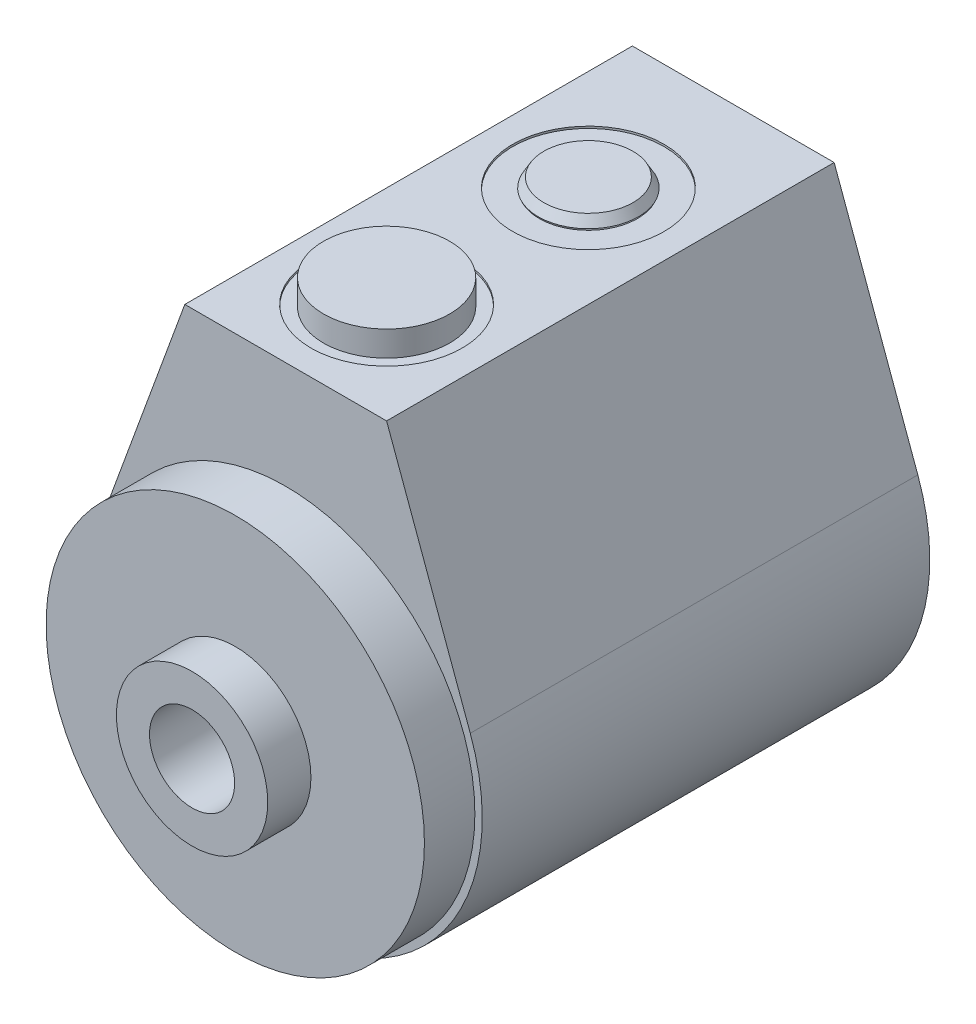
ISO-10303-21;
HEADER;
FILE_DESCRIPTION(('STEP AP214'),'2;1');
FILE_NAME('part.step','',(''),(''),'','','');
FILE_SCHEMA(('AUTOMOTIVE_DESIGN { 1 0 10303 214 1 1 1 1 }'));
ENDSEC;
DATA;
#1=APPLICATION_CONTEXT('core data for automotive mechanical design processes');
#2=APPLICATION_PROTOCOL_DEFINITION('international standard','automotive_design',2000,#1);
#3=PRODUCT_CONTEXT('',#1,'mechanical');
#4=PRODUCT('Part','Part','',(#3));
#5=PRODUCT_RELATED_PRODUCT_CATEGORY('part','',(#4));
#6=PRODUCT_DEFINITION_FORMATION('','',#4);
#7=PRODUCT_DEFINITION_CONTEXT('part definition',#1,'design');
#8=PRODUCT_DEFINITION('design','',#6,#7);
#9=PRODUCT_DEFINITION_SHAPE('','',#8);
#10=(LENGTH_UNIT() NAMED_UNIT(*) SI_UNIT(.MILLI.,.METRE.));
#11=(NAMED_UNIT(*) PLANE_ANGLE_UNIT() SI_UNIT($,.RADIAN.));
#12=(NAMED_UNIT(*) SI_UNIT($,.STERADIAN.) SOLID_ANGLE_UNIT());
#13=UNCERTAINTY_MEASURE_WITH_UNIT(LENGTH_MEASURE(1.E-05),#10,'distance_accuracy_value','');
#14=(GEOMETRIC_REPRESENTATION_CONTEXT(3) GLOBAL_UNCERTAINTY_ASSIGNED_CONTEXT((#13)) GLOBAL_UNIT_ASSIGNED_CONTEXT((#10,
#11,#12)) REPRESENTATION_CONTEXT('',''));
#15=CARTESIAN_POINT('',(0.,0.,0.));
#16=DIRECTION('',(0.,0.,1.));
#17=DIRECTION('',(1.,0.,0.));
#18=AXIS2_PLACEMENT_3D('',#15,#16,#17);
#19=CARTESIAN_POINT('',(0.,38.481,18.2372));
#20=DIRECTION('',(0.,-1.,0.));
#21=DIRECTION('',(0.,0.,-1.));
#22=AXIS2_PLACEMENT_3D('',#19,#20,#21);
#23=PLANE('',#22);
#24=CARTESIAN_POINT('',(0.,38.481,18.2372));
#25=DIRECTION('',(0.,1.,0.));
#26=DIRECTION('',(0.,0.,1.));
#27=AXIS2_PLACEMENT_3D('',#24,#25,#26);
#28=CIRCLE('',#27,5.60995924864142);
#29=CARTESIAN_POINT('',(0.,38.481,23.8471592486414));
#30=VERTEX_POINT('',#29);
#31=EDGE_CURVE('E11',#30,#30,#28,.T.);
#32=ORIENTED_EDGE('',*,*,#31,.T.);
#33=EDGE_LOOP('',(#32));
#34=FACE_BOUND('',#33,.T.);
#35=ADVANCED_FACE('F42',(#34),#23,.F.);
#36=CARTESIAN_POINT('',(0.,37.2872,18.2372));
#37=DIRECTION('',(0.,-1.,0.));
#38=DIRECTION('',(0.,0.,-1.));
#39=AXIS2_PLACEMENT_3D('',#36,#37,#38);
#40=CONICAL_SURFACE('',#39,6.2992,0.523598775598302);
#41=ORIENTED_EDGE('',*,*,#31,.F.);
#42=EDGE_LOOP('',(#41));
#43=FACE_BOUND('',#42,.T.);
#44=CARTESIAN_POINT('',(0.,37.2872,18.2372));
#45=DIRECTION('',(0.,1.,0.));
#46=DIRECTION('',(0.,0.,1.));
#47=AXIS2_PLACEMENT_3D('',#44,#45,#46);
#48=CIRCLE('',#47,6.2992);
#49=CARTESIAN_POINT('',(0.,37.2872,24.5364));
#50=VERTEX_POINT('',#49);
#51=EDGE_CURVE('E48',#50,#50,#48,.T.);
#52=ORIENTED_EDGE('',*,*,#51,.T.);
#53=EDGE_LOOP('',(#52));
#54=FACE_BOUND('',#53,.T.);
#55=ADVANCED_FACE('F54',(#43,#54),#40,.T.);
#56=CARTESIAN_POINT('',(0.,37.2872,11.938));
#57=DIRECTION('',(0.,1.,0.));
#58=DIRECTION('',(0.,0.,1.));
#59=AXIS2_PLACEMENT_3D('',#56,#57,#58);
#60=PLANE('',#59);
#61=ORIENTED_EDGE('',*,*,#51,.F.);
#62=EDGE_LOOP('',(#61));
#63=FACE_BOUND('',#62,.T.);
#64=ADVANCED_FACE('F56',(#63),#60,.F.);
#65=CLOSED_SHELL('',(#35,#55,#64));
#66=MANIFOLD_SOLID_BREP('B2',#65);
#67=CARTESIAN_POINT('',(0.,22.225,0.431799999999998));
#68=DIRECTION('',(0.,0.,1.));
#69=DIRECTION('',(1.,0.,0.));
#70=AXIS2_PLACEMENT_3D('',#67,#68,#69);
#71=TOROIDAL_SURFACE('',#70,4.7117,0.889000000000001);
#72=CARTESIAN_POINT('',(5.6007,22.225,0.431799999999998));
#73=VERTEX_POINT('',#72);
#74=VERTEX_LOOP('',#73);
#75=FACE_BOUND('',#74,.T.);
#76=ADVANCED_FACE('F92',(#75),#71,.T.);
#77=CLOSED_SHELL('',(#76));
#78=MANIFOLD_SOLID_BREP('B6',#77);
#79=CARTESIAN_POINT('',(12.7,37.2872,0.));
#80=DIRECTION('',(0.,1.,0.));
#81=DIRECTION('',(0.,0.,1.));
#82=AXIS2_PLACEMENT_3D('',#79,#80,#81);
#83=PLANE('',#82);
#84=DIRECTION('',(-1.,0.,0.));
#85=VECTOR('',#84,1.);
#86=CARTESIAN_POINT('',(12.7,37.2872,56.3372));
#87=LINE('',#86,#85);
#88=CARTESIAN_POINT('',(12.7,37.2872,56.3372));
#89=VERTEX_POINT('',#88);
#90=CARTESIAN_POINT('',(-12.7,37.2872,56.3372));
#91=VERTEX_POINT('',#90);
#92=EDGE_CURVE('E158',#89,#91,#87,.T.);
#93=ORIENTED_EDGE('',*,*,#92,.F.);
#94=DIRECTION('',(0.,0.,1.));
#95=VECTOR('',#94,1.);
#96=CARTESIAN_POINT('',(12.7,37.2872,0.));
#97=LINE('',#96,#95);
#98=CARTESIAN_POINT('',(12.7,37.2872,0.));
#99=VERTEX_POINT('',#98);
#100=EDGE_CURVE('E153',#99,#89,#97,.T.);
#101=ORIENTED_EDGE('',*,*,#100,.F.);
#102=DIRECTION('',(-1.,0.,0.));
#103=VECTOR('',#102,1.);
#104=CARTESIAN_POINT('',(12.7,37.2872,0.));
#105=LINE('',#104,#103);
#106=CARTESIAN_POINT('',(-12.7,37.2872,0.));
#107=VERTEX_POINT('',#106);
#108=EDGE_CURVE('E156',#99,#107,#105,.T.);
#109=ORIENTED_EDGE('',*,*,#108,.T.);
#110=DIRECTION('',(0.,0.,1.));
#111=VECTOR('',#110,1.);
#112=CARTESIAN_POINT('',(-12.7,37.2872,0.));
#113=LINE('',#112,#111);
#114=EDGE_CURVE('E139',#107,#91,#113,.T.);
#115=ORIENTED_EDGE('',*,*,#114,.T.);
#116=EDGE_LOOP('',(#93,#101,#109,#115));
#117=FACE_BOUND('',#116,.T.);
#118=CARTESIAN_POINT('',(0.,37.2872,43.6372));
#119=DIRECTION('',(0.,1.,0.));
#120=DIRECTION('',(0.,0.,1.));
#121=AXIS2_PLACEMENT_3D('',#118,#119,#120);
#122=CIRCLE('',#121,9.52500000000001);
#123=CARTESIAN_POINT('',(0.,37.2872,53.1622));
#124=VERTEX_POINT('',#123);
#125=EDGE_CURVE('E243',#124,#124,#122,.T.);
#126=ORIENTED_EDGE('',*,*,#125,.F.);
#127=EDGE_LOOP('',(#126));
#128=FACE_BOUND('',#127,.T.);
#129=CARTESIAN_POINT('',(0.,37.2872,18.2372));
#130=DIRECTION('',(0.,-1.,0.));
#131=DIRECTION('',(0.,0.,-1.));
#132=AXIS2_PLACEMENT_3D('',#129,#130,#131);
#133=CIRCLE('',#132,9.52499999998571);
#134=CARTESIAN_POINT('',(0.,37.2872,8.71220000001428));
#135=VERTEX_POINT('',#134);
#136=EDGE_CURVE('E259',#135,#135,#133,.T.);
#137=ORIENTED_EDGE('',*,*,#136,.T.);
#138=EDGE_LOOP('',(#137));
#139=FACE_BOUND('',#138,.T.);
#140=ADVANCED_FACE('F106',(#117,#128,#139),#83,.T.);
#141=CARTESIAN_POINT('',(0.,0.,6.35));
#142=DIRECTION('',(0.,0.,1.));
#143=DIRECTION('',(1.,0.,0.));
#144=AXIS2_PLACEMENT_3D('',#141,#142,#143);
#145=PLANE('',#144);
#146=CARTESIAN_POINT('',(0.,0.,6.35));
#147=DIRECTION('',(0.,0.,-1.));
#148=DIRECTION('',(-1.,0.,0.));
#149=AXIS2_PLACEMENT_3D('',#146,#147,#148);
#150=CIRCLE('',#149,11.938);
#151=CARTESIAN_POINT('',(-11.938,0.,6.35));
#152=VERTEX_POINT('',#151);
#153=EDGE_CURVE('E240',#152,#152,#150,.T.);
#154=ORIENTED_EDGE('',*,*,#153,.T.);
#155=EDGE_LOOP('',(#154));
#156=FACE_BOUND('',#155,.T.);
#157=CARTESIAN_POINT('',(0.,0.,6.35));
#158=DIRECTION('',(0.,0.,1.));
#159=DIRECTION('',(1.,0.,0.));
#160=AXIS2_PLACEMENT_3D('',#157,#158,#159);
#161=CIRCLE('',#160,9.525);
#162=CARTESIAN_POINT('',(9.525,0.,6.35));
#163=VERTEX_POINT('',#162);
#164=EDGE_CURVE('E90',#163,#163,#161,.F.);
#165=ORIENTED_EDGE('',*,*,#164,.F.);
#166=EDGE_LOOP('',(#165));
#167=FACE_BOUND('',#166,.T.);
#168=ADVANCED_FACE('F197',(#156,#167),#145,.F.);
#169=CARTESIAN_POINT('',(0.,0.,56.3372));
#170=DIRECTION('',(0.,0.,1.));
#171=DIRECTION('',(1.,0.,0.));
#172=AXIS2_PLACEMENT_3D('',#169,#170,#171);
#173=PLANE('',#172);
#174=CARTESIAN_POINT('',(0.,0.,56.3372));
#175=DIRECTION('',(0.,0.,1.));
#176=DIRECTION('',(1.,0.,0.));
#177=AXIS2_PLACEMENT_3D('',#174,#175,#176);
#178=CIRCLE('',#177,24.7396);
#179=CARTESIAN_POINT('',(-23.2330948392539,8.5012418122432,56.3372));
#180=VERTEX_POINT('',#179);
#181=CARTESIAN_POINT('',(23.2330948392539,8.5012418122432,56.3372));
#182=VERTEX_POINT('',#181);
#183=EDGE_CURVE('E174',#180,#182,#178,.T.);
#184=ORIENTED_EDGE('',*,*,#183,.T.);
#185=DIRECTION('',(-0.34362891122909,0.93910551663139,0.));
#186=VECTOR('',#185,1.);
#187=CARTESIAN_POINT('',(23.2330948392539,8.5012418122432,56.3372));
#188=LINE('',#187,#186);
#189=EDGE_CURVE('E177',#182,#89,#188,.T.);
#190=ORIENTED_EDGE('',*,*,#189,.T.);
#191=ORIENTED_EDGE('',*,*,#92,.T.);
#192=DIRECTION('',(-0.34362891122909,-0.93910551663139,0.));
#193=VECTOR('',#192,1.);
#194=CARTESIAN_POINT('',(-12.7,37.2872,56.3372));
#195=LINE('',#194,#193);
#196=EDGE_CURVE('E169',#91,#180,#195,.T.);
#197=ORIENTED_EDGE('',*,*,#196,.T.);
#198=EDGE_LOOP('',(#184,#190,#191,#197));
#199=FACE_BOUND('',#198,.T.);
#200=CARTESIAN_POINT('',(0.,0.,56.3372));
#201=DIRECTION('',(0.,0.,1.));
#202=DIRECTION('',(1.,0.,0.));
#203=AXIS2_PLACEMENT_3D('',#200,#201,#202);
#204=CIRCLE('',#203,23.8125);
#205=CARTESIAN_POINT('',(23.8125,0.,56.3372));
#206=VERTEX_POINT('',#205);
#207=EDGE_CURVE('E246',#206,#206,#204,.T.);
#208=ORIENTED_EDGE('',*,*,#207,.F.);
#209=EDGE_LOOP('',(#208));
#210=FACE_BOUND('',#209,.T.);
#211=ADVANCED_FACE('F185',(#199,#210),#173,.T.);
#212=CARTESIAN_POINT('',(0.,0.,0.));
#213=DIRECTION('',(0.,0.,1.));
#214=DIRECTION('',(1.,0.,0.));
#215=AXIS2_PLACEMENT_3D('',#212,#213,#214);
#216=CYLINDRICAL_SURFACE('',#215,24.7396);
#217=ORIENTED_EDGE('',*,*,#183,.F.);
#218=DIRECTION('',(0.,0.,1.));
#219=VECTOR('',#218,1.);
#220=CARTESIAN_POINT('',(-23.2330948392539,8.5012418122432,0.));
#221=LINE('',#220,#219);
#222=CARTESIAN_POINT('',(-23.2330948392539,8.5012418122432,0.));
#223=VERTEX_POINT('',#222);
#224=EDGE_CURVE('E115',#223,#180,#221,.T.);
#225=ORIENTED_EDGE('',*,*,#224,.F.);
#226=CARTESIAN_POINT('',(0.,0.,0.));
#227=DIRECTION('',(0.,0.,1.));
#228=DIRECTION('',(1.,0.,0.));
#229=AXIS2_PLACEMENT_3D('',#226,#227,#228);
#230=CIRCLE('',#229,24.7396);
#231=CARTESIAN_POINT('',(23.2330948392539,8.5012418122432,0.));
#232=VERTEX_POINT('',#231);
#233=EDGE_CURVE('E167',#223,#232,#230,.T.);
#234=ORIENTED_EDGE('',*,*,#233,.T.);
#235=DIRECTION('',(0.,0.,1.));
#236=VECTOR('',#235,1.);
#237=CARTESIAN_POINT('',(23.2330948392539,8.5012418122432,0.));
#238=LINE('',#237,#236);
#239=EDGE_CURVE('E150',#232,#182,#238,.T.);
#240=ORIENTED_EDGE('',*,*,#239,.T.);
#241=EDGE_LOOP('',(#217,#225,#234,#240));
#242=FACE_BOUND('',#241,.T.);
#243=ADVANCED_FACE('F108',(#242),#216,.T.);
#244=CARTESIAN_POINT('',(-12.7,37.2872,0.));
#245=DIRECTION('',(-0.93910551663139,0.34362891122909,0.));
#246=DIRECTION('',(-0.34362891122909,-0.93910551663139,0.));
#247=AXIS2_PLACEMENT_3D('',#244,#245,#246);
#248=PLANE('',#247);
#249=ORIENTED_EDGE('',*,*,#196,.F.);
#250=ORIENTED_EDGE('',*,*,#114,.F.);
#251=DIRECTION('',(-0.34362891122909,-0.93910551663139,0.));
#252=VECTOR('',#251,1.);
#253=CARTESIAN_POINT('',(-12.7,37.2872,0.));
#254=LINE('',#253,#252);
#255=EDGE_CURVE('E164',#107,#223,#254,.T.);
#256=ORIENTED_EDGE('',*,*,#255,.T.);
#257=ORIENTED_EDGE('',*,*,#224,.T.);
#258=EDGE_LOOP('',(#249,#250,#256,#257));
#259=FACE_BOUND('',#258,.T.);
#260=ADVANCED_FACE('F187',(#259),#248,.T.);
#261=CARTESIAN_POINT('',(23.2330948392539,8.5012418122432,0.));
#262=DIRECTION('',(0.93910551663139,0.34362891122909,0.));
#263=DIRECTION('',(-0.34362891122909,0.93910551663139,0.));
#264=AXIS2_PLACEMENT_3D('',#261,#262,#263);
#265=PLANE('',#264);
#266=ORIENTED_EDGE('',*,*,#189,.F.);
#267=ORIENTED_EDGE('',*,*,#239,.F.);
#268=DIRECTION('',(-0.34362891122909,0.93910551663139,0.));
#269=VECTOR('',#268,1.);
#270=CARTESIAN_POINT('',(23.2330948392539,8.5012418122432,0.));
#271=LINE('',#270,#269);
#272=EDGE_CURVE('E163',#232,#99,#271,.T.);
#273=ORIENTED_EDGE('',*,*,#272,.T.);
#274=ORIENTED_EDGE('',*,*,#100,.T.);
#275=EDGE_LOOP('',(#266,#267,#273,#274));
#276=FACE_BOUND('',#275,.T.);
#277=ADVANCED_FACE('F166',(#276),#265,.T.);
#278=CARTESIAN_POINT('',(0.,0.,0.));
#279=DIRECTION('',(0.,0.,1.));
#280=DIRECTION('',(1.,0.,0.));
#281=AXIS2_PLACEMENT_3D('',#278,#279,#280);
#282=PLANE('',#281);
#283=CARTESIAN_POINT('',(0.,22.225,0.));
#284=DIRECTION('',(0.,0.,-1.));
#285=DIRECTION('',(-1.,0.,0.));
#286=AXIS2_PLACEMENT_3D('',#283,#284,#285);
#287=CIRCLE('',#286,5.6007);
#288=CARTESIAN_POINT('',(-5.6007,22.225,0.));
#289=VERTEX_POINT('',#288);
#290=EDGE_CURVE('E227',#289,#289,#287,.T.);
#291=ORIENTED_EDGE('',*,*,#290,.F.);
#292=EDGE_LOOP('',(#291));
#293=FACE_BOUND('',#292,.T.);
#294=CARTESIAN_POINT('',(-18.2626,-1.27527128061192E-13,0.));
#295=DIRECTION('',(0.,0.,-1.));
#296=DIRECTION('',(-1.,0.,0.));
#297=AXIS2_PLACEMENT_3D('',#294,#295,#296);
#298=CIRCLE('',#297,3.31470000000001);
#299=CARTESIAN_POINT('',(-21.5773,-1.27527128061192E-13,0.));
#300=VERTEX_POINT('',#299);
#301=EDGE_CURVE('E231',#300,#300,#298,.T.);
#302=ORIENTED_EDGE('',*,*,#301,.F.);
#303=EDGE_LOOP('',(#302));
#304=FACE_BOUND('',#303,.T.);
#305=CARTESIAN_POINT('',(18.2626,0.,0.));
#306=DIRECTION('',(0.,0.,-1.));
#307=DIRECTION('',(-1.,0.,0.));
#308=AXIS2_PLACEMENT_3D('',#305,#306,#307);
#309=CIRCLE('',#308,3.31470000000001);
#310=CARTESIAN_POINT('',(14.9479,0.,0.));
#311=VERTEX_POINT('',#310);
#312=EDGE_CURVE('E235',#311,#311,#309,.T.);
#313=ORIENTED_EDGE('',*,*,#312,.F.);
#314=EDGE_LOOP('',(#313));
#315=FACE_BOUND('',#314,.T.);
#316=CARTESIAN_POINT('',(0.,0.,0.));
#317=DIRECTION('',(0.,0.,-1.));
#318=DIRECTION('',(-1.,0.,0.));
#319=AXIS2_PLACEMENT_3D('',#316,#317,#318);
#320=CIRCLE('',#319,11.938);
#321=CARTESIAN_POINT('',(-11.938,0.,0.));
#322=VERTEX_POINT('',#321);
#323=EDGE_CURVE('E238',#322,#322,#320,.T.);
#324=ORIENTED_EDGE('',*,*,#323,.F.);
#325=EDGE_LOOP('',(#324));
#326=FACE_BOUND('',#325,.T.);
#327=ORIENTED_EDGE('',*,*,#233,.F.);
#328=ORIENTED_EDGE('',*,*,#255,.F.);
#329=ORIENTED_EDGE('',*,*,#108,.F.);
#330=ORIENTED_EDGE('',*,*,#272,.F.);
#331=EDGE_LOOP('',(#327,#328,#329,#330));
#332=FACE_BOUND('',#331,.T.);
#333=ADVANCED_FACE('F162',(#293,#304,#315,#326,#332),#282,.F.);
#334=CARTESIAN_POINT('',(0.,37.0332,43.6372));
#335=DIRECTION('',(0.,-1.,0.));
#336=DIRECTION('',(0.,0.,-1.));
#337=AXIS2_PLACEMENT_3D('',#334,#335,#336);
#338=PLANE('',#337);
#339=CARTESIAN_POINT('',(0.,37.0332,43.6372));
#340=DIRECTION('',(0.,1.,0.));
#341=DIRECTION('',(0.,0.,1.));
#342=AXIS2_PLACEMENT_3D('',#339,#340,#341);
#343=CIRCLE('',#342,7.9375);
#344=CARTESIAN_POINT('',(0.,37.0332,51.5747));
#345=VERTEX_POINT('',#344);
#346=EDGE_CURVE('E283',#345,#345,#343,.T.);
#347=ORIENTED_EDGE('',*,*,#346,.F.);
#348=EDGE_LOOP('',(#347));
#349=FACE_BOUND('',#348,.T.);
#350=CARTESIAN_POINT('',(0.,37.0332,43.6372));
#351=DIRECTION('',(0.,1.,0.));
#352=DIRECTION('',(0.,0.,1.));
#353=AXIS2_PLACEMENT_3D('',#350,#351,#352);
#354=CIRCLE('',#353,9.52500000000001);
#355=CARTESIAN_POINT('',(0.,37.0332,53.1622));
#356=VERTEX_POINT('',#355);
#357=EDGE_CURVE('E178',#356,#356,#354,.T.);
#358=ORIENTED_EDGE('',*,*,#357,.T.);
#359=EDGE_LOOP('',(#358));
#360=FACE_BOUND('',#359,.T.);
#361=ADVANCED_FACE('F215',(#349,#360),#338,.F.);
#362=CARTESIAN_POINT('',(0.,37.2872,43.6372));
#363=DIRECTION('',(0.,1.,0.));
#364=DIRECTION('',(0.,0.,1.));
#365=AXIS2_PLACEMENT_3D('',#362,#363,#364);
#366=CYLINDRICAL_SURFACE('',#365,9.52500000000001);
#367=ORIENTED_EDGE('',*,*,#357,.F.);
#368=EDGE_LOOP('',(#367));
#369=FACE_BOUND('',#368,.T.);
#370=ORIENTED_EDGE('',*,*,#125,.T.);
#371=EDGE_LOOP('',(#370));
#372=FACE_BOUND('',#371,.T.);
#373=ADVANCED_FACE('F212',(#369,#372),#366,.F.);
#374=CARTESIAN_POINT('',(0.,0.,0.));
#375=DIRECTION('',(0.,0.,-1.));
#376=DIRECTION('',(-1.,0.,0.));
#377=AXIS2_PLACEMENT_3D('',#374,#375,#376);
#378=CYLINDRICAL_SURFACE('',#377,11.938);
#379=ORIENTED_EDGE('',*,*,#153,.F.);
#380=EDGE_LOOP('',(#379));
#381=FACE_BOUND('',#380,.T.);
#382=ORIENTED_EDGE('',*,*,#323,.T.);
#383=EDGE_LOOP('',(#382));
#384=FACE_BOUND('',#383,.T.);
#385=ADVANCED_FACE('F210',(#381,#384),#378,.F.);
#386=CARTESIAN_POINT('',(0.,0.,0.));
#387=DIRECTION('',(0.,0.,1.));
#388=DIRECTION('',(1.,0.,0.));
#389=AXIS2_PLACEMENT_3D('',#386,#387,#388);
#390=CYLINDRICAL_SURFACE('',#389,9.525);
#391=CARTESIAN_POINT('',(0.,0.,68.1228));
#392=DIRECTION('',(0.,0.,1.));
#393=DIRECTION('',(1.,0.,0.));
#394=AXIS2_PLACEMENT_3D('',#391,#392,#393);
#395=CIRCLE('',#394,9.525);
#396=CARTESIAN_POINT('',(9.525,0.,68.1228));
#397=VERTEX_POINT('',#396);
#398=EDGE_CURVE('E241',#397,#397,#395,.T.);
#399=ORIENTED_EDGE('',*,*,#398,.F.);
#400=EDGE_LOOP('',(#399));
#401=FACE_BOUND('',#400,.T.);
#402=CARTESIAN_POINT('',(0.,0.,62.6872));
#403=DIRECTION('',(0.,0.,1.));
#404=DIRECTION('',(1.,0.,0.));
#405=AXIS2_PLACEMENT_3D('',#402,#403,#404);
#406=CIRCLE('',#405,9.525);
#407=CARTESIAN_POINT('',(9.525,0.,62.6872));
#408=VERTEX_POINT('',#407);
#409=EDGE_CURVE('E289',#408,#408,#406,.T.);
#410=ORIENTED_EDGE('',*,*,#409,.T.);
#411=EDGE_LOOP('',(#410));
#412=FACE_BOUND('',#411,.T.);
#413=ADVANCED_FACE('F310',(#401,#412),#390,.T.);
#414=CARTESIAN_POINT('',(9.525,0.,68.1228));
#415=DIRECTION('',(0.,0.,-1.));
#416=DIRECTION('',(-1.,0.,0.));
#417=AXIS2_PLACEMENT_3D('',#414,#415,#416);
#418=PLANE('',#417);
#419=CARTESIAN_POINT('',(0.,0.,68.1228));
#420=DIRECTION('',(0.,0.,-1.));
#421=DIRECTION('',(-1.,0.,0.));
#422=AXIS2_PLACEMENT_3D('',#419,#420,#421);
#423=CIRCLE('',#422,5.3594);
#424=CARTESIAN_POINT('',(-5.3594,0.,68.1228));
#425=VERTEX_POINT('',#424);
#426=EDGE_CURVE('E625',#425,#425,#423,.T.);
#427=ORIENTED_EDGE('',*,*,#426,.T.);
#428=EDGE_LOOP('',(#427));
#429=FACE_BOUND('',#428,.T.);
#430=ORIENTED_EDGE('',*,*,#398,.T.);
#431=EDGE_LOOP('',(#430));
#432=FACE_BOUND('',#431,.T.);
#433=ADVANCED_FACE('F300',(#429,#432),#418,.F.);
#434=CARTESIAN_POINT('',(0.,0.,0.));
#435=DIRECTION('',(0.,0.,1.));
#436=DIRECTION('',(1.,0.,0.));
#437=AXIS2_PLACEMENT_3D('',#434,#435,#436);
#438=CYLINDRICAL_SURFACE('',#437,23.8125);
#439=CARTESIAN_POINT('',(0.,0.,62.6872));
#440=DIRECTION('',(0.,0.,1.));
#441=DIRECTION('',(1.,0.,0.));
#442=AXIS2_PLACEMENT_3D('',#439,#440,#441);
#443=CIRCLE('',#442,23.8125);
#444=CARTESIAN_POINT('',(23.8125,0.,62.6872));
#445=VERTEX_POINT('',#444);
#446=EDGE_CURVE('E292',#445,#445,#443,.T.);
#447=ORIENTED_EDGE('',*,*,#446,.F.);
#448=EDGE_LOOP('',(#447));
#449=FACE_BOUND('',#448,.T.);
#450=ORIENTED_EDGE('',*,*,#207,.T.);
#451=EDGE_LOOP('',(#450));
#452=FACE_BOUND('',#451,.T.);
#453=ADVANCED_FACE('F297',(#449,#452),#438,.T.);
#454=CARTESIAN_POINT('',(23.8125,0.,62.6872));
#455=DIRECTION('',(0.,0.,-1.));
#456=DIRECTION('',(-1.,0.,0.));
#457=AXIS2_PLACEMENT_3D('',#454,#455,#456);
#458=PLANE('',#457);
#459=ORIENTED_EDGE('',*,*,#409,.F.);
#460=EDGE_LOOP('',(#459));
#461=FACE_BOUND('',#460,.T.);
#462=ORIENTED_EDGE('',*,*,#446,.T.);
#463=EDGE_LOOP('',(#462));
#464=FACE_BOUND('',#463,.T.);
#465=ADVANCED_FACE('F299',(#461,#464),#458,.F.);
#466=CARTESIAN_POINT('',(0.,0.,0.));
#467=DIRECTION('',(0.,0.,1.));
#468=DIRECTION('',(1.,0.,0.));
#469=AXIS2_PLACEMENT_3D('',#466,#467,#468);
#470=CYLINDRICAL_SURFACE('',#469,9.525);
#471=ORIENTED_EDGE('',*,*,#164,.T.);
#472=EDGE_LOOP('',(#471));
#473=FACE_BOUND('',#472,.T.);
#474=CARTESIAN_POINT('',(0.,0.,5.41020000000001));
#475=DIRECTION('',(0.,0.,1.));
#476=DIRECTION('',(1.,0.,0.));
#477=AXIS2_PLACEMENT_3D('',#474,#475,#476);
#478=CIRCLE('',#477,9.525);
#479=CARTESIAN_POINT('',(9.525,0.,5.41020000000001));
#480=VERTEX_POINT('',#479);
#481=EDGE_CURVE('E286',#480,#480,#478,.T.);
#482=ORIENTED_EDGE('',*,*,#481,.T.);
#483=EDGE_LOOP('',(#482));
#484=FACE_BOUND('',#483,.T.);
#485=ADVANCED_FACE('F307',(#473,#484),#470,.T.);
#486=CARTESIAN_POINT('',(0.,0.,5.4102));
#487=DIRECTION('',(0.,0.,1.));
#488=DIRECTION('',(1.,0.,0.));
#489=AXIS2_PLACEMENT_3D('',#486,#487,#488);
#490=PLANE('',#489);
#491=CARTESIAN_POINT('',(0.,0.,5.4102));
#492=DIRECTION('',(0.,0.,-1.));
#493=DIRECTION('',(-1.,0.,0.));
#494=AXIS2_PLACEMENT_3D('',#491,#492,#493);
#495=CIRCLE('',#494,6.7437);
#496=CARTESIAN_POINT('',(-6.7437,0.,5.4102));
#497=VERTEX_POINT('',#496);
#498=EDGE_CURVE('E615',#497,#497,#495,.T.);
#499=ORIENTED_EDGE('',*,*,#498,.F.);
#500=EDGE_LOOP('',(#499));
#501=FACE_BOUND('',#500,.T.);
#502=ORIENTED_EDGE('',*,*,#481,.F.);
#503=EDGE_LOOP('',(#502));
#504=FACE_BOUND('',#503,.T.);
#505=ADVANCED_FACE('F355',(#501,#504),#490,.F.);
#506=CARTESIAN_POINT('',(0.,0.,43.6372));
#507=DIRECTION('',(0.,1.,0.));
#508=DIRECTION('',(0.,0.,1.));
#509=AXIS2_PLACEMENT_3D('',#506,#507,#508);
#510=CYLINDRICAL_SURFACE('',#509,7.9375);
#511=ORIENTED_EDGE('',*,*,#346,.T.);
#512=EDGE_LOOP('',(#511));
#513=FACE_BOUND('',#512,.T.);
#514=CARTESIAN_POINT('',(0.,40.2082,43.6372));
#515=DIRECTION('',(0.,1.,0.));
#516=DIRECTION('',(0.,0.,1.));
#517=AXIS2_PLACEMENT_3D('',#514,#515,#516);
#518=CIRCLE('',#517,7.9375);
#519=CARTESIAN_POINT('',(0.,40.2082,51.5747));
#520=VERTEX_POINT('',#519);
#521=EDGE_CURVE('E280',#520,#520,#518,.T.);
#522=ORIENTED_EDGE('',*,*,#521,.F.);
#523=EDGE_LOOP('',(#522));
#524=FACE_BOUND('',#523,.T.);
#525=ADVANCED_FACE('F349',(#513,#524),#510,.T.);
#526=CARTESIAN_POINT('',(0.,40.2082,43.6372));
#527=DIRECTION('',(0.,1.,0.));
#528=DIRECTION('',(0.,0.,1.));
#529=AXIS2_PLACEMENT_3D('',#526,#527,#528);
#530=PLANE('',#529);
#531=ORIENTED_EDGE('',*,*,#521,.T.);
#532=EDGE_LOOP('',(#531));
#533=FACE_BOUND('',#532,.T.);
#534=ADVANCED_FACE('F354',(#533),#530,.T.);
#535=CARTESIAN_POINT('',(0.,37.2872,18.2372));
#536=DIRECTION('',(0.,-1.,0.));
#537=DIRECTION('',(0.,0.,-1.));
#538=AXIS2_PLACEMENT_3D('',#535,#536,#537);
#539=CYLINDRICAL_SURFACE('',#538,4.97839999999999);
#540=CARTESIAN_POINT('',(0.,24.7523,13.2588));
#541=CARTESIAN_POINT('',(-0.13261659127768,24.7522900276658,13.2588085299582));
#542=CARTESIAN_POINT('',(-0.265389770122497,24.741799530817,13.2641560495247));
#543=CARTESIAN_POINT('',(-0.526993428038586,24.700305259563,13.2850237827705));
#544=CARTESIAN_POINT('',(-0.655816278382708,24.6692641246099,13.3005625233541));
#545=CARTESIAN_POINT('',(-0.905342776725247,24.5882054629459,13.3401886693019));
#546=CARTESIAN_POINT('',(-1.02607613315222,24.5382624242271,13.3642424949526));
#547=CARTESIAN_POINT('',(-1.25726221687394,24.4212106200684,13.4187060029328));
#548=CARTESIAN_POINT('',(-1.36771555083688,24.354102868469,13.4491153098539));
#549=CARTESIAN_POINT('',(-1.58288413005532,24.1999202878497,13.5157172258062));
#550=CARTESIAN_POINT('',(-1.68682286637342,24.1118677656031,13.5521511074013));
#551=CARTESIAN_POINT('',(-1.87917737408086,23.9203973648212,13.6259319573975));
#552=CARTESIAN_POINT('',(-1.96758092316611,23.8169675052168,13.6632796186319));
#553=CARTESIAN_POINT('',(-2.13350053903378,23.5877293668111,13.7381359499134));
#554=CARTESIAN_POINT('',(-2.20956554544842,23.460789480357,13.7754151533443));
#555=CARTESIAN_POINT('',(-2.33896086426842,23.1937260642199,13.8418536134685));
#556=CARTESIAN_POINT('',(-2.39230776915569,23.0536122479244,13.8710187909374));
#557=CARTESIAN_POINT('',(-2.45207376975219,22.8411085754775,13.9045029840385));
#558=CARTESIAN_POINT('',(-2.46838280372515,22.7721548598921,13.9138000778918));
#559=CARTESIAN_POINT('',(-2.49519039753379,22.6327913411232,13.9292149049661));
#560=CARTESIAN_POINT('',(-2.50569208658107,22.5623823433593,13.9353343503128));
#561=CARTESIAN_POINT('',(-2.52071237379575,22.4207586917638,13.9441180385076));
#562=CARTESIAN_POINT('',(-2.52523484376645,22.3495445894375,13.9467845172781));
#563=CARTESIAN_POINT('',(-2.52824280410908,22.2069674798887,13.9485578475427));
#564=CARTESIAN_POINT('',(-2.52672890280478,22.1356044883951,13.9476650577272));
#565=CARTESIAN_POINT('',(-2.51426653077545,21.940009957821,13.9403337952646));
#566=CARTESIAN_POINT('',(-2.49709700350196,21.8162437441302,13.930240193116));
#567=CARTESIAN_POINT('',(-2.4451060669328,21.5737515386129,13.900520812398));
#568=CARTESIAN_POINT('',(-2.41027873543161,21.4550272522731,13.8808918358764));
#569=CARTESIAN_POINT('',(-2.32335688329703,21.2224933949532,13.8339099565705));
#570=CARTESIAN_POINT('',(-2.27088039736632,21.1088618221091,13.8063883750545));
#571=CARTESIAN_POINT('',(-2.15044368174874,20.8914699215554,13.7467023251715));
#572=CARTESIAN_POINT('',(-2.0824764908903,20.7877140615742,13.7145357718478));
#573=CARTESIAN_POINT('',(-1.92259363057266,20.5786751335004,13.644087141609));
#574=CARTESIAN_POINT('',(-1.8287055956384,20.4749788444821,13.6055565094403));
#575=CARTESIAN_POINT('',(-1.62474317475928,20.2841306452798,13.5301306325413));
#576=CARTESIAN_POINT('',(-1.51466064073018,20.196987114301,13.4932362232916));
#577=CARTESIAN_POINT('',(-1.27458719136206,20.0376690366911,13.4230260645708));
#578=CARTESIAN_POINT('',(-1.14388293099881,19.966442745152,13.3899759498329));
#579=CARTESIAN_POINT('',(-0.870246800649719,19.847582421231,13.3334678013628));
#580=CARTESIAN_POINT('',(-0.727325031088194,19.7999291176954,13.3100019351572));
#581=CARTESIAN_POINT('',(-0.446255597122189,19.7335832075791,13.2769955450988));
#582=CARTESIAN_POINT('',(-0.308725040654668,19.712783654163,13.2664458703244));
#583=CARTESIAN_POINT('',(-0.0317424184832481,19.6940959730701,13.2569768819727));
#584=CARTESIAN_POINT('',(0.107708660033476,19.6961964832857,13.2580518007288));
#585=CARTESIAN_POINT('',(0.372635500099716,19.7220671553955,13.2711356647503));
#586=CARTESIAN_POINT('',(0.498333139513688,19.7440807090404,13.2822581670231));
#587=CARTESIAN_POINT('',(0.743985779036224,19.8063657535513,13.3131484658814));
#588=CARTESIAN_POINT('',(0.863940153050111,19.8466392300115,13.332917202655));
#589=CARTESIAN_POINT('',(1.0985922172448,19.9453074597419,13.3800103424116));
#590=CARTESIAN_POINT('',(1.2130498753702,20.0041764432299,13.4075301586215));
#591=CARTESIAN_POINT('',(1.43083131364532,20.1378224619565,13.4675074398571));
#592=CARTESIAN_POINT('',(1.53415039403049,20.2126061729166,13.499966975305));
#593=CARTESIAN_POINT('',(1.73773810807158,20.3846170059992,13.5705658731608));
#594=CARTESIAN_POINT('',(1.83665727636688,20.4833441534529,13.6089482318908));
#595=CARTESIAN_POINT('',(2.01715345767672,20.6960100375963,13.6847105620106));
#596=CARTESIAN_POINT('',(2.09871755584904,20.8099600004705,13.7220897689513));
#597=CARTESIAN_POINT('',(2.24625180670659,21.0573523946937,13.7935644407868));
#598=CARTESIAN_POINT('',(2.31117788975808,21.1915042855957,13.8273843107707));
#599=CARTESIAN_POINT('',(2.41683976360677,21.4710868638288,13.8843839404874));
#600=CARTESIAN_POINT('',(2.45760761932864,21.6165023098213,13.9075777946789));
#601=CARTESIAN_POINT('',(2.50996166078672,21.8994468873866,13.9377359817114));
#602=CARTESIAN_POINT('',(2.52399155300663,22.0363759552616,13.9460545105337));
#603=CARTESIAN_POINT('',(2.52956297577896,22.3108242004218,13.9493331424009));
#604=CARTESIAN_POINT('',(2.52111530745411,22.4483430625867,13.9442996614791));
#605=CARTESIAN_POINT('',(2.48427286352209,22.7053990681028,13.9228958060484));
#606=CARTESIAN_POINT('',(2.45797801043227,22.8253499466246,13.9077212851727));
#607=CARTESIAN_POINT('',(2.38884153925738,23.0589866311494,13.8691959475279));
#608=CARTESIAN_POINT('',(2.34599445886677,23.1726703547978,13.8458424318937));
#609=CARTESIAN_POINT('',(2.24177489718089,23.3989845576317,13.7916887269604));
#610=CARTESIAN_POINT('',(2.17935454835108,23.5110354082792,13.7604947801255));
#611=CARTESIAN_POINT('',(2.03889290543717,23.7238110144641,13.6948002388264));
#612=CARTESIAN_POINT('',(1.96084336379825,23.8245297460058,13.6602979035503));
#613=CARTESIAN_POINT('',(1.77974805019795,24.0250602900794,13.5866445873597));
#614=CARTESIAN_POINT('',(1.67478840982836,24.1231415496494,13.547458302413));
#615=CARTESIAN_POINT('',(1.44890260254745,24.3007149705103,13.4728198071452));
#616=CARTESIAN_POINT('',(1.32796755535973,24.3801967242567,13.4373696935054));
#617=CARTESIAN_POINT('',(1.07122366824717,24.5187203869743,13.3736071166534));
#618=CARTESIAN_POINT('',(0.935271160622096,24.5775374328396,13.3453740354824));
#619=CARTESIAN_POINT('',(0.724296764636722,24.6474253720884,13.311251144096));
#620=CARTESIAN_POINT('',(0.652848935682752,24.6676575004687,13.3012519997792));
#621=CARTESIAN_POINT('',(0.508124013182336,24.7018061885043,13.2842649453234));
#622=CARTESIAN_POINT('',(0.434848042121435,24.7157265276074,13.2772752332879));
#623=CARTESIAN_POINT('',(0.301336687219172,24.7349952435318,13.2675678971043));
#624=CARTESIAN_POINT('',(0.241302865966993,24.7414771539034,13.2642872696033));
#625=CARTESIAN_POINT('',(0.120856879777811,24.7501318629618,13.2599013477543));
#626=CARTESIAN_POINT('',(0.060444704664634,24.7523045452442,13.2587961121697));
#627=CARTESIAN_POINT('',(0.,24.7523,13.2588));
#628=B_SPLINE_CURVE_WITH_KNOTS('',3,(#540,#541,#542,#543,#544,#545,#546,#547,#548,#549,#550,
#551,#552,#553,#554,#555,#556,#557,#558,#559,#560,#561,#562,#563,#564,#565,#566,#567,#568,#569,
#570,#571,#572,#573,#574,#575,#576,#577,#578,#579,#580,#581,#582,#583,#584,#585,#586,#587,#588,
#589,#590,#591,#592,#593,#594,#595,#596,#597,#598,#599,#600,#601,#602,#603,#604,#605,#606,#607,
#608,#609,#610,#611,#612,#613,#614,#615,#616,#617,#618,#619,#620,#621,#622,#623,#624,#625,#626,
#627),.UNSPECIFIED.,.T.,.F.,(4,2,2,2,2,2,2,2,2,2,2,2,2,2,2,2,2,2,2,2,2,2,2,2,2,2,2,2,2,2,2,2,2,
2,2,2,2,2,2,2,2,2,2,4),(0.,0.397614971363318,0.795954789116521,1.1927409172486,1.58950361446291,
2.01078721347415,2.43240078762916,2.88798346681235,3.34323283178574,3.55735863654545,
3.77136894971897,3.98524061396084,4.19909072553085,4.57322988846704,4.94749461606216,
5.33044496295776,5.71356773955439,6.14697341836704,6.58059791104613,7.03557215975349,
7.4901738452285,7.9063611567909,8.32234198203752,8.70486301236412,9.08742564822258,
9.48066168212998,9.87406299231764,10.3069903458446,10.7402387458515,11.1962430239787,
11.6516406895167,12.0629360635005,12.4740338337709,12.8436280057757,13.2133442497665,
13.6078027489349,14.0024699557676,14.4471238677663,14.8920259986347,15.3416294146478,
15.5661244096106,15.7904848007084,15.9717069999177,16.1529340943766),.UNSPECIFIED.);
#629=CARTESIAN_POINT('',(0.,24.7523,13.2588));
#630=VERTEX_POINT('',#629);
#631=EDGE_CURVE('E604',#630,#630,#628,.T.);
#632=ORIENTED_EDGE('',*,*,#631,.F.);
#633=EDGE_LOOP('',(#632));
#634=FACE_BOUND('',#633,.T.);
#635=CARTESIAN_POINT('',(0.,16.4591999999615,18.2372));
#636=DIRECTION('',(0.,-1.,0.));
#637=DIRECTION('',(0.,0.,-1.));
#638=AXIS2_PLACEMENT_3D('',#635,#636,#637);
#639=CIRCLE('',#638,4.97839999999999);
#640=CARTESIAN_POINT('',(0.,16.4591999999615,13.2588));
#641=VERTEX_POINT('',#640);
#642=EDGE_CURVE('E262',#641,#641,#639,.T.);
#643=ORIENTED_EDGE('',*,*,#642,.T.);
#644=EDGE_LOOP('',(#643));
#645=FACE_BOUND('',#644,.T.);
#646=CARTESIAN_POINT('',(0.,33.8165931349366,18.2372));
#647=DIRECTION('',(0.,-1.,0.));
#648=DIRECTION('',(0.,0.,-1.));
#649=AXIS2_PLACEMENT_3D('',#646,#647,#648);
#650=CIRCLE('',#649,4.9784);
#651=CARTESIAN_POINT('',(0.,33.8165931349366,13.2588));
#652=VERTEX_POINT('',#651);
#653=EDGE_CURVE('E277',#652,#652,#650,.T.);
#654=ORIENTED_EDGE('',*,*,#653,.F.);
#655=EDGE_LOOP('',(#654));
#656=FACE_BOUND('',#655,.T.);
#657=ADVANCED_FACE('F366',(#634,#645,#656),#539,.F.);
#658=CARTESIAN_POINT('',(0.,34.4804999999762,18.2372));
#659=DIRECTION('',(0.,1.,0.));
#660=DIRECTION('',(0.,0.,1.));
#661=AXIS2_PLACEMENT_3D('',#658,#659,#660);
#662=CONICAL_SURFACE('',#661,5.64230686503958,0.785398163397458);
#663=ORIENTED_EDGE('',*,*,#653,.T.);
#664=EDGE_LOOP('',(#663));
#665=FACE_BOUND('',#664,.T.);
#666=CARTESIAN_POINT('',(0.,34.4804999999762,18.2372));
#667=DIRECTION('',(0.,-1.,0.));
#668=DIRECTION('',(0.,0.,-1.));
#669=AXIS2_PLACEMENT_3D('',#666,#667,#668);
#670=CIRCLE('',#669,5.64230686503958);
#671=CARTESIAN_POINT('',(0.,34.4804999999762,12.5948931349604));
#672=VERTEX_POINT('',#671);
#673=EDGE_CURVE('E274',#672,#672,#670,.T.);
#674=ORIENTED_EDGE('',*,*,#673,.F.);
#675=EDGE_LOOP('',(#674));
#676=FACE_BOUND('',#675,.T.);
#677=ADVANCED_FACE('F379',(#665,#676),#662,.F.);
#678=CARTESIAN_POINT('',(0.,37.0332,18.2372));
#679=DIRECTION('',(0.,1.,0.));
#680=DIRECTION('',(0.,0.,1.));
#681=AXIS2_PLACEMENT_3D('',#678,#679,#680);
#682=CONICAL_SURFACE('',#681,6.18490000002008,0.20943951023946);
#683=ORIENTED_EDGE('',*,*,#673,.T.);
#684=EDGE_LOOP('',(#683));
#685=FACE_BOUND('',#684,.T.);
#686=CARTESIAN_POINT('',(0.,37.0332,18.2372));
#687=DIRECTION('',(0.,-1.,0.));
#688=DIRECTION('',(0.,0.,-1.));
#689=AXIS2_PLACEMENT_3D('',#686,#687,#688);
#690=CIRCLE('',#689,6.18490000002008);
#691=CARTESIAN_POINT('',(0.,37.0332,12.0522999999799));
#692=VERTEX_POINT('',#691);
#693=EDGE_CURVE('E265',#692,#692,#690,.T.);
#694=ORIENTED_EDGE('',*,*,#693,.F.);
#695=EDGE_LOOP('',(#694));
#696=FACE_BOUND('',#695,.T.);
#697=ADVANCED_FACE('F384',(#685,#696),#682,.F.);
#698=CARTESIAN_POINT('',(-9.52499999998571,37.0332,18.2372));
#699=DIRECTION('',(0.,1.,0.));
#700=DIRECTION('',(0.,0.,1.));
#701=AXIS2_PLACEMENT_3D('',#698,#699,#700);
#702=PLANE('',#701);
#703=ORIENTED_EDGE('',*,*,#693,.T.);
#704=EDGE_LOOP('',(#703));
#705=FACE_BOUND('',#704,.T.);
#706=CARTESIAN_POINT('',(0.,37.0332,18.2372));
#707=DIRECTION('',(0.,-1.,0.));
#708=DIRECTION('',(0.,0.,-1.));
#709=AXIS2_PLACEMENT_3D('',#706,#707,#708);
#710=CIRCLE('',#709,9.52499999998571);
#711=CARTESIAN_POINT('',(0.,37.0332,8.71220000001428));
#712=VERTEX_POINT('',#711);
#713=EDGE_CURVE('E261',#712,#712,#710,.T.);
#714=ORIENTED_EDGE('',*,*,#713,.F.);
#715=EDGE_LOOP('',(#714));
#716=FACE_BOUND('',#715,.T.);
#717=ADVANCED_FACE('F394',(#705,#716),#702,.T.);
#718=CARTESIAN_POINT('',(0.,37.2872,18.2372));
#719=DIRECTION('',(0.,-1.,0.));
#720=DIRECTION('',(0.,0.,-1.));
#721=AXIS2_PLACEMENT_3D('',#718,#719,#720);
#722=CYLINDRICAL_SURFACE('',#721,9.52499999998571);
#723=ORIENTED_EDGE('',*,*,#713,.T.);
#724=EDGE_LOOP('',(#723));
#725=FACE_BOUND('',#724,.T.);
#726=ORIENTED_EDGE('',*,*,#136,.F.);
#727=EDGE_LOOP('',(#726));
#728=FACE_BOUND('',#727,.T.);
#729=ADVANCED_FACE('F404',(#725,#728),#722,.F.);
#730=CARTESIAN_POINT('',(-4.97839999999999,16.4591999999615,18.2372));
#731=DIRECTION('',(0.,1.,0.));
#732=DIRECTION('',(0.,0.,1.));
#733=AXIS2_PLACEMENT_3D('',#730,#731,#732);
#734=PLANE('',#733);
#735=ORIENTED_EDGE('',*,*,#642,.F.);
#736=EDGE_LOOP('',(#735));
#737=FACE_BOUND('',#736,.T.);
#738=ADVANCED_FACE('F414',(#737),#734,.T.);
#739=CARTESIAN_POINT('',(18.2626,0.,12.7));
#740=DIRECTION('',(0.,0.,1.));
#741=DIRECTION('',(1.,0.,0.));
#742=AXIS2_PLACEMENT_3D('',#739,#740,#741);
#743=PLANE('',#742);
#744=CARTESIAN_POINT('',(18.2626,0.,12.7));
#745=DIRECTION('',(0.,0.,-1.));
#746=DIRECTION('',(-1.,0.,0.));
#747=AXIS2_PLACEMENT_3D('',#744,#745,#746);
#748=CIRCLE('',#747,3.31470000000001);
#749=CARTESIAN_POINT('',(14.9479,0.,12.7));
#750=VERTEX_POINT('',#749);
#751=EDGE_CURVE('E633',#750,#750,#748,.T.);
#752=ORIENTED_EDGE('',*,*,#751,.T.);
#753=EDGE_LOOP('',(#752));
#754=FACE_BOUND('',#753,.T.);
#755=ADVANCED_FACE('F424',(#754),#743,.F.);
#756=CARTESIAN_POINT('',(18.2626,0.,0.));
#757=DIRECTION('',(0.,0.,-1.));
#758=DIRECTION('',(-1.,0.,0.));
#759=AXIS2_PLACEMENT_3D('',#756,#757,#758);
#760=CYLINDRICAL_SURFACE('',#759,3.31470000000001);
#761=ORIENTED_EDGE('',*,*,#751,.F.);
#762=EDGE_LOOP('',(#761));
#763=FACE_BOUND('',#762,.T.);
#764=ORIENTED_EDGE('',*,*,#312,.T.);
#765=EDGE_LOOP('',(#764));
#766=FACE_BOUND('',#765,.T.);
#767=ADVANCED_FACE('F486',(#763,#766),#760,.F.);
#768=CARTESIAN_POINT('',(-18.2626,-1.27527128061192E-13,12.7));
#769=DIRECTION('',(0.,0.,1.));
#770=DIRECTION('',(1.,0.,0.));
#771=AXIS2_PLACEMENT_3D('',#768,#769,#770);
#772=PLANE('',#771);
#773=CARTESIAN_POINT('',(-18.2626,-1.27527128061192E-13,12.7));
#774=DIRECTION('',(0.,0.,-1.));
#775=DIRECTION('',(-1.,0.,0.));
#776=AXIS2_PLACEMENT_3D('',#773,#774,#775);
#777=CIRCLE('',#776,3.31470000000001);
#778=CARTESIAN_POINT('',(-21.5773,-1.27527128061192E-13,12.7));
#779=VERTEX_POINT('',#778);
#780=EDGE_CURVE('E629',#779,#779,#777,.T.);
#781=ORIENTED_EDGE('',*,*,#780,.T.);
#782=EDGE_LOOP('',(#781));
#783=FACE_BOUND('',#782,.T.);
#784=ADVANCED_FACE('F496',(#783),#772,.F.);
#785=CARTESIAN_POINT('',(-18.2626,-1.27527128061192E-13,0.));
#786=DIRECTION('',(0.,0.,-1.));
#787=DIRECTION('',(-1.,0.,0.));
#788=AXIS2_PLACEMENT_3D('',#785,#786,#787);
#789=CYLINDRICAL_SURFACE('',#788,3.31470000000001);
#790=ORIENTED_EDGE('',*,*,#780,.F.);
#791=EDGE_LOOP('',(#790));
#792=FACE_BOUND('',#791,.T.);
#793=ORIENTED_EDGE('',*,*,#301,.T.);
#794=EDGE_LOOP('',(#793));
#795=FACE_BOUND('',#794,.T.);
#796=ADVANCED_FACE('F506',(#792,#795),#789,.F.);
#797=CARTESIAN_POINT('',(0.,0.,5.4102));
#798=DIRECTION('',(0.,0.,-1.));
#799=DIRECTION('',(-1.,0.,0.));
#800=AXIS2_PLACEMENT_3D('',#797,#798,#799);
#801=CYLINDRICAL_SURFACE('',#800,5.3594);
#802=ORIENTED_EDGE('',*,*,#426,.F.);
#803=EDGE_LOOP('',(#802));
#804=FACE_BOUND('',#803,.T.);
#805=CARTESIAN_POINT('',(0.,0.,53.9939713549199));
#806=DIRECTION('',(0.,0.,-1.));
#807=DIRECTION('',(-1.,0.,0.));
#808=AXIS2_PLACEMENT_3D('',#805,#806,#807);
#809=CIRCLE('',#808,5.3594);
#810=CARTESIAN_POINT('',(-5.3594,0.,53.9939713549199));
#811=VERTEX_POINT('',#810);
#812=EDGE_CURVE('E622',#811,#811,#809,.T.);
#813=ORIENTED_EDGE('',*,*,#812,.T.);
#814=EDGE_LOOP('',(#813));
#815=FACE_BOUND('',#814,.T.);
#816=ADVANCED_FACE('F516',(#804,#815),#801,.F.);
#817=CARTESIAN_POINT('',(0.,0.,53.1622));
#818=DIRECTION('',(0.,0.,-1.));
#819=DIRECTION('',(-1.,0.,0.));
#820=AXIS2_PLACEMENT_3D('',#817,#818,#819);
#821=CONICAL_SURFACE('',#820,6.74369999999999,1.02974425867665);
#822=ORIENTED_EDGE('',*,*,#812,.F.);
#823=EDGE_LOOP('',(#822));
#824=FACE_BOUND('',#823,.T.);
#825=CARTESIAN_POINT('',(0.,0.,53.1622));
#826=DIRECTION('',(0.,0.,-1.));
#827=DIRECTION('',(-1.,0.,0.));
#828=AXIS2_PLACEMENT_3D('',#825,#826,#827);
#829=CIRCLE('',#828,6.74369999999999);
#830=CARTESIAN_POINT('',(-6.74369999999999,0.,53.1622));
#831=VERTEX_POINT('',#830);
#832=EDGE_CURVE('E619',#831,#831,#829,.T.);
#833=ORIENTED_EDGE('',*,*,#832,.T.);
#834=EDGE_LOOP('',(#833));
#835=FACE_BOUND('',#834,.T.);
#836=ADVANCED_FACE('F541',(#824,#835),#821,.F.);
#837=CARTESIAN_POINT('',(0.,0.,5.4102));
#838=DIRECTION('',(0.,0.,-1.));
#839=DIRECTION('',(-1.,0.,0.));
#840=AXIS2_PLACEMENT_3D('',#837,#838,#839);
#841=CYLINDRICAL_SURFACE('',#840,6.7437);
#842=ORIENTED_EDGE('',*,*,#832,.F.);
#843=EDGE_LOOP('',(#842));
#844=FACE_BOUND('',#843,.T.);
#845=ORIENTED_EDGE('',*,*,#498,.T.);
#846=EDGE_LOOP('',(#845));
#847=FACE_BOUND('',#846,.T.);
#848=ADVANCED_FACE('F551',(#844,#847),#841,.F.);
#849=CARTESIAN_POINT('',(0.,22.225,1.3208));
#850=DIRECTION('',(0.,0.,-1.));
#851=DIRECTION('',(-1.,0.,0.));
#852=AXIS2_PLACEMENT_3D('',#849,#850,#851);
#853=CYLINDRICAL_SURFACE('',#852,5.6007);
#854=ORIENTED_EDGE('',*,*,#290,.T.);
#855=EDGE_LOOP('',(#854));
#856=FACE_BOUND('',#855,.T.);
#857=CARTESIAN_POINT('',(0.,22.225,1.3208));
#858=DIRECTION('',(0.,0.,-1.));
#859=DIRECTION('',(-1.,0.,0.));
#860=AXIS2_PLACEMENT_3D('',#857,#858,#859);
#861=CIRCLE('',#860,5.6007);
#862=CARTESIAN_POINT('',(-5.6007,22.225,1.3208));
#863=VERTEX_POINT('',#862);
#864=EDGE_CURVE('E611',#863,#863,#861,.T.);
#865=ORIENTED_EDGE('',*,*,#864,.F.);
#866=EDGE_LOOP('',(#865));
#867=FACE_BOUND('',#866,.T.);
#868=ADVANCED_FACE('F560',(#856,#867),#853,.F.);
#869=CARTESIAN_POINT('',(0.,22.225,1.3208));
#870=DIRECTION('',(0.,0.,-1.));
#871=DIRECTION('',(-1.,0.,0.));
#872=AXIS2_PLACEMENT_3D('',#869,#870,#871);
#873=PLANE('',#872);
#874=ORIENTED_EDGE('',*,*,#864,.T.);
#875=EDGE_LOOP('',(#874));
#876=FACE_BOUND('',#875,.T.);
#877=CARTESIAN_POINT('',(0.,22.225,1.3208));
#878=DIRECTION('',(0.,0.,-1.));
#879=DIRECTION('',(-1.,0.,0.));
#880=AXIS2_PLACEMENT_3D('',#877,#878,#879);
#881=CIRCLE('',#880,2.5273);
#882=CARTESIAN_POINT('',(-2.5273,22.225,1.3208));
#883=VERTEX_POINT('',#882);
#884=EDGE_CURVE('E610',#883,#883,#881,.T.);
#885=ORIENTED_EDGE('',*,*,#884,.F.);
#886=EDGE_LOOP('',(#885));
#887=FACE_BOUND('',#886,.T.);
#888=ADVANCED_FACE('F583',(#876,#887),#873,.T.);
#889=CARTESIAN_POINT('',(0.,22.225,14.0208));
#890=DIRECTION('',(0.,0.,-1.));
#891=DIRECTION('',(-1.,0.,0.));
#892=AXIS2_PLACEMENT_3D('',#889,#890,#891);
#893=CYLINDRICAL_SURFACE('',#892,2.5273);
#894=ORIENTED_EDGE('',*,*,#631,.T.);
#895=EDGE_LOOP('',(#894));
#896=FACE_BOUND('',#895,.T.);
#897=ORIENTED_EDGE('',*,*,#884,.T.);
#898=EDGE_LOOP('',(#897));
#899=FACE_BOUND('',#898,.T.);
#900=ADVANCED_FACE('F580',(#896,#899),#893,.F.);
#901=CLOSED_SHELL('',(#140,#168,#211,#243,#260,#277,#333,#361,#373,#385,#413,#433,#453,#465,
#485,#505,#525,#534,#657,#677,#697,#717,#729,#738,#755,#767,#784,#796,#816,#836,#848,#868,#888,#900));
#902=CARTESIAN_POINT('',(0.,34.4805,43.6372));
#903=DIRECTION('',(0.,1.,0.));
#904=DIRECTION('',(0.,0.,1.));
#905=AXIS2_PLACEMENT_3D('',#902,#903,#904);
#906=CONICAL_SURFACE('',#905,5.64230686502494,0.209439510252187);
#907=CARTESIAN_POINT('',(0.,37.0332,43.6372));
#908=DIRECTION('',(0.,1.,0.));
#909=DIRECTION('',(0.,0.,1.));
#910=AXIS2_PLACEMENT_3D('',#907,#908,#909);
#911=CIRCLE('',#910,6.18490000003434);
#912=CARTESIAN_POINT('',(0.,37.0332,49.8221000000343));
#913=VERTEX_POINT('',#912);
#914=EDGE_CURVE('E268',#913,#913,#911,.T.);
#915=ORIENTED_EDGE('',*,*,#914,.T.);
#916=EDGE_LOOP('',(#915));
#917=FACE_BOUND('',#916,.T.);
#918=CARTESIAN_POINT('',(0.,34.4805,43.6372));
#919=DIRECTION('',(0.,1.,0.));
#920=DIRECTION('',(0.,0.,1.));
#921=AXIS2_PLACEMENT_3D('',#918,#919,#920);
#922=CIRCLE('',#921,5.64230686502494);
#923=CARTESIAN_POINT('',(0.,34.4805,49.2795068650249));
#924=VERTEX_POINT('',#923);
#925=EDGE_CURVE('E636',#924,#924,#922,.T.);
#926=ORIENTED_EDGE('',*,*,#925,.F.);
#927=EDGE_LOOP('',(#926));
#928=FACE_BOUND('',#927,.T.);
#929=ADVANCED_FACE('F432',(#917,#928),#906,.F.);
#930=CARTESIAN_POINT('',(6.18490000003434,37.0332,43.6372));
#931=DIRECTION('',(0.,-1.,0.));
#932=DIRECTION('',(0.,0.,-1.));
#933=AXIS2_PLACEMENT_3D('',#930,#931,#932);
#934=PLANE('',#933);
#935=ORIENTED_EDGE('',*,*,#914,.F.);
#936=EDGE_LOOP('',(#935));
#937=FACE_BOUND('',#936,.T.);
#938=ADVANCED_FACE('F436',(#937),#934,.T.);
#939=CARTESIAN_POINT('',(0.,23.5711999999758,43.6372));
#940=DIRECTION('',(0.,1.,0.));
#941=DIRECTION('',(0.,0.,1.));
#942=AXIS2_PLACEMENT_3D('',#939,#940,#941);
#943=PLANE('',#942);
#944=CARTESIAN_POINT('',(0.,23.5711999999758,43.6372));
#945=DIRECTION('',(0.,1.,0.));
#946=DIRECTION('',(0.,0.,1.));
#947=AXIS2_PLACEMENT_3D('',#944,#945,#946);
#948=CIRCLE('',#947,4.9784);
#949=CARTESIAN_POINT('',(0.,23.5711999999758,48.6156));
#950=VERTEX_POINT('',#949);
#951=EDGE_CURVE('E642',#950,#950,#948,.T.);
#952=ORIENTED_EDGE('',*,*,#951,.T.);
#953=EDGE_LOOP('',(#952));
#954=FACE_BOUND('',#953,.T.);
#955=ADVANCED_FACE('F448',(#954),#943,.T.);
#956=CARTESIAN_POINT('',(0.,0.,43.6372));
#957=DIRECTION('',(0.,1.,0.));
#958=DIRECTION('',(0.,0.,1.));
#959=AXIS2_PLACEMENT_3D('',#956,#957,#958);
#960=CYLINDRICAL_SURFACE('',#959,4.9784);
#961=CARTESIAN_POINT('',(0.,33.8165931349751,43.6372));
#962=DIRECTION('',(0.,1.,0.));
#963=DIRECTION('',(0.,0.,1.));
#964=AXIS2_PLACEMENT_3D('',#961,#962,#963);
#965=CIRCLE('',#964,4.9784);
#966=CARTESIAN_POINT('',(0.,33.8165931349751,48.6156));
#967=VERTEX_POINT('',#966);
#968=EDGE_CURVE('E639',#967,#967,#965,.T.);
#969=ORIENTED_EDGE('',*,*,#968,.T.);
#970=EDGE_LOOP('',(#969));
#971=FACE_BOUND('',#970,.T.);
#972=ORIENTED_EDGE('',*,*,#951,.F.);
#973=EDGE_LOOP('',(#972));
#974=FACE_BOUND('',#973,.T.);
#975=ADVANCED_FACE('F458',(#971,#974),#960,.F.);
#976=CARTESIAN_POINT('',(0.,33.8165931349751,43.6372));
#977=DIRECTION('',(0.,1.,0.));
#978=DIRECTION('',(0.,0.,1.));
#979=AXIS2_PLACEMENT_3D('',#976,#977,#978);
#980=CONICAL_SURFACE('',#979,4.9784,0.785398163397457);
#981=ORIENTED_EDGE('',*,*,#925,.T.);
#982=EDGE_LOOP('',(#981));
#983=FACE_BOUND('',#982,.T.);
#984=ORIENTED_EDGE('',*,*,#968,.F.);
#985=EDGE_LOOP('',(#984));
#986=FACE_BOUND('',#985,.T.);
#987=ADVANCED_FACE('F468',(#983,#986),#980,.F.);
#988=CLOSED_SHELL('',(#929,#938,#955,#975,#987));
#989=ORIENTED_CLOSED_SHELL('',*,#988,.T.);
#990=BREP_WITH_VOIDS('B38',#901,(#989));
#991=ADVANCED_BREP_SHAPE_REPRESENTATION('',(#18,#66,#78,#990),#14);
#992=SHAPE_DEFINITION_REPRESENTATION(#9,#991);
ENDSEC;
END-ISO-10303-21;
